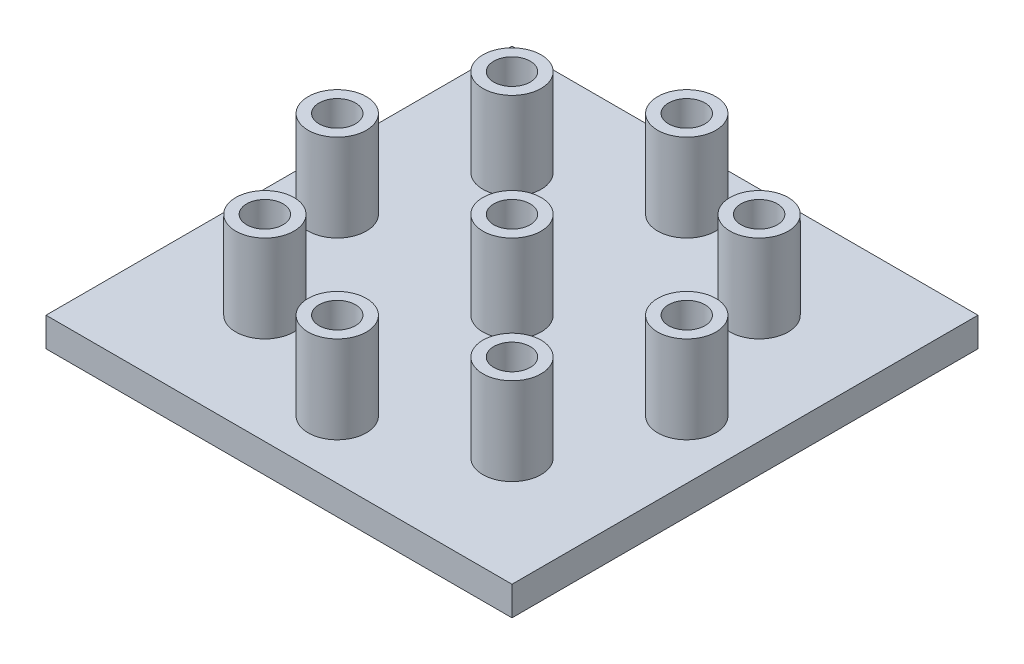
ISO-10303-21;
HEADER;
FILE_DESCRIPTION(('STEP AP214'),'2;1');
FILE_NAME('part.step','',(''),(''),'','','');
FILE_SCHEMA(('AUTOMOTIVE_DESIGN { 1 0 10303 214 1 1 1 1 }'));
ENDSEC;
DATA;
#1=APPLICATION_CONTEXT('core data for automotive mechanical design processes');
#2=APPLICATION_PROTOCOL_DEFINITION('international standard','automotive_design',2000,#1);
#3=PRODUCT_CONTEXT('',#1,'mechanical');
#4=PRODUCT('Part','Part','',(#3));
#5=PRODUCT_RELATED_PRODUCT_CATEGORY('part','',(#4));
#6=PRODUCT_DEFINITION_FORMATION('','',#4);
#7=PRODUCT_DEFINITION_CONTEXT('part definition',#1,'design');
#8=PRODUCT_DEFINITION('design','',#6,#7);
#9=PRODUCT_DEFINITION_SHAPE('','',#8);
#10=(LENGTH_UNIT() NAMED_UNIT(*) SI_UNIT(.MILLI.,.METRE.));
#11=(NAMED_UNIT(*) PLANE_ANGLE_UNIT() SI_UNIT($,.RADIAN.));
#12=(NAMED_UNIT(*) SI_UNIT($,.STERADIAN.) SOLID_ANGLE_UNIT());
#13=UNCERTAINTY_MEASURE_WITH_UNIT(LENGTH_MEASURE(1.E-05),#10,'distance_accuracy_value','');
#14=(GEOMETRIC_REPRESENTATION_CONTEXT(3) GLOBAL_UNCERTAINTY_ASSIGNED_CONTEXT((#13)) GLOBAL_UNIT_ASSIGNED_CONTEXT((#10,
#11,#12)) REPRESENTATION_CONTEXT('',''));
#15=CARTESIAN_POINT('',(0.,0.,0.));
#16=DIRECTION('',(0.,0.,1.));
#17=DIRECTION('',(1.,0.,0.));
#18=AXIS2_PLACEMENT_3D('',#15,#16,#17);
#19=CARTESIAN_POINT('',(25.4,3.175,25.4));
#20=DIRECTION('',(-1.,0.,0.));
#21=DIRECTION('',(0.,0.,1.));
#22=AXIS2_PLACEMENT_3D('',#19,#20,#21);
#23=PLANE('',#22);
#24=DIRECTION('',(0.,0.,-1.));
#25=VECTOR('',#24,1.);
#26=CARTESIAN_POINT('',(25.4,0.,25.4));
#27=LINE('',#26,#25);
#28=CARTESIAN_POINT('',(25.4,0.,25.4));
#29=VERTEX_POINT('',#28);
#30=CARTESIAN_POINT('',(25.4,0.,-25.4));
#31=VERTEX_POINT('',#30);
#32=EDGE_CURVE('E111',#29,#31,#27,.T.);
#33=ORIENTED_EDGE('',*,*,#32,.T.);
#34=DIRECTION('',(0.,-1.,0.));
#35=VECTOR('',#34,1.);
#36=CARTESIAN_POINT('',(25.4,3.175,-25.4));
#37=LINE('',#36,#35);
#38=CARTESIAN_POINT('',(25.4,3.175,-25.4));
#39=VERTEX_POINT('',#38);
#40=EDGE_CURVE('E100',#39,#31,#37,.T.);
#41=ORIENTED_EDGE('',*,*,#40,.F.);
#42=DIRECTION('',(0.,0.,-1.));
#43=VECTOR('',#42,1.);
#44=CARTESIAN_POINT('',(25.4,3.175,25.4));
#45=LINE('',#44,#43);
#46=CARTESIAN_POINT('',(25.4,3.175,25.4));
#47=VERTEX_POINT('',#46);
#48=EDGE_CURVE('E92',#47,#39,#45,.T.);
#49=ORIENTED_EDGE('',*,*,#48,.F.);
#50=DIRECTION('',(0.,-1.,0.));
#51=VECTOR('',#50,1.);
#52=CARTESIAN_POINT('',(25.4,3.175,25.4));
#53=LINE('',#52,#51);
#54=EDGE_CURVE('E107',#47,#29,#53,.T.);
#55=ORIENTED_EDGE('',*,*,#54,.T.);
#56=EDGE_LOOP('',(#33,#41,#49,#55));
#57=FACE_BOUND('',#56,.T.);
#58=ADVANCED_FACE('F39',(#57),#23,.F.);
#59=CARTESIAN_POINT('',(-25.4,3.175,-25.4));
#60=DIRECTION('',(0.,0.,1.));
#61=DIRECTION('',(1.,0.,0.));
#62=AXIS2_PLACEMENT_3D('',#59,#60,#61);
#63=PLANE('',#62);
#64=DIRECTION('',(-1.,0.,0.));
#65=VECTOR('',#64,1.);
#66=CARTESIAN_POINT('',(-25.4,0.,-25.4));
#67=LINE('',#66,#65);
#68=CARTESIAN_POINT('',(-25.4,0.,-25.4));
#69=VERTEX_POINT('',#68);
#70=EDGE_CURVE('E98',#31,#69,#67,.T.);
#71=ORIENTED_EDGE('',*,*,#70,.T.);
#72=DIRECTION('',(0.,-1.,0.));
#73=VECTOR('',#72,1.);
#74=CARTESIAN_POINT('',(-25.4,3.175,-25.4));
#75=LINE('',#74,#73);
#76=CARTESIAN_POINT('',(-25.4,3.175,-25.4));
#77=VERTEX_POINT('',#76);
#78=EDGE_CURVE('E96',#77,#69,#75,.T.);
#79=ORIENTED_EDGE('',*,*,#78,.F.);
#80=DIRECTION('',(-1.,0.,0.));
#81=VECTOR('',#80,1.);
#82=CARTESIAN_POINT('',(-25.4,3.175,-25.4));
#83=LINE('',#82,#81);
#84=EDGE_CURVE('E87',#39,#77,#83,.T.);
#85=ORIENTED_EDGE('',*,*,#84,.F.);
#86=ORIENTED_EDGE('',*,*,#40,.T.);
#87=EDGE_LOOP('',(#71,#79,#85,#86));
#88=FACE_BOUND('',#87,.T.);
#89=ADVANCED_FACE('F97',(#88),#63,.F.);
#90=CARTESIAN_POINT('',(-25.4,3.175,25.4));
#91=DIRECTION('',(1.,0.,0.));
#92=DIRECTION('',(0.,0.,-1.));
#93=AXIS2_PLACEMENT_3D('',#90,#91,#92);
#94=PLANE('',#93);
#95=DIRECTION('',(0.,0.,1.));
#96=VECTOR('',#95,1.);
#97=CARTESIAN_POINT('',(-25.4,0.,25.4));
#98=LINE('',#97,#96);
#99=CARTESIAN_POINT('',(-25.4,0.,25.4));
#100=VERTEX_POINT('',#99);
#101=EDGE_CURVE('E73',#69,#100,#98,.T.);
#102=ORIENTED_EDGE('',*,*,#101,.T.);
#103=DIRECTION('',(0.,-1.,0.));
#104=VECTOR('',#103,1.);
#105=CARTESIAN_POINT('',(-25.4,3.175,25.4));
#106=LINE('',#105,#104);
#107=CARTESIAN_POINT('',(-25.4,3.175,25.4));
#108=VERTEX_POINT('',#107);
#109=EDGE_CURVE('E101',#108,#100,#106,.T.);
#110=ORIENTED_EDGE('',*,*,#109,.F.);
#111=DIRECTION('',(0.,0.,1.));
#112=VECTOR('',#111,1.);
#113=CARTESIAN_POINT('',(-25.4,3.175,25.4));
#114=LINE('',#113,#112);
#115=EDGE_CURVE('E90',#77,#108,#114,.T.);
#116=ORIENTED_EDGE('',*,*,#115,.F.);
#117=ORIENTED_EDGE('',*,*,#78,.T.);
#118=EDGE_LOOP('',(#102,#110,#116,#117));
#119=FACE_BOUND('',#118,.T.);
#120=ADVANCED_FACE('F103',(#119),#94,.F.);
#121=CARTESIAN_POINT('',(-25.4,3.175,25.4));
#122=DIRECTION('',(0.,0.,-1.));
#123=DIRECTION('',(-1.,0.,0.));
#124=AXIS2_PLACEMENT_3D('',#121,#122,#123);
#125=PLANE('',#124);
#126=DIRECTION('',(1.,0.,0.));
#127=VECTOR('',#126,1.);
#128=CARTESIAN_POINT('',(-25.4,0.,25.4));
#129=LINE('',#128,#127);
#130=EDGE_CURVE('E79',#100,#29,#129,.T.);
#131=ORIENTED_EDGE('',*,*,#130,.T.);
#132=ORIENTED_EDGE('',*,*,#54,.F.);
#133=DIRECTION('',(1.,0.,0.));
#134=VECTOR('',#133,1.);
#135=CARTESIAN_POINT('',(-25.4,3.175,25.4));
#136=LINE('',#135,#134);
#137=EDGE_CURVE('E56',#108,#47,#136,.T.);
#138=ORIENTED_EDGE('',*,*,#137,.F.);
#139=ORIENTED_EDGE('',*,*,#109,.T.);
#140=EDGE_LOOP('',(#131,#132,#138,#139));
#141=FACE_BOUND('',#140,.T.);
#142=ADVANCED_FACE('F164',(#141),#125,.F.);
#143=CARTESIAN_POINT('',(0.,3.175,0.));
#144=DIRECTION('',(0.,-1.,0.));
#145=DIRECTION('',(0.,0.,-1.));
#146=AXIS2_PLACEMENT_3D('',#143,#144,#145);
#147=PLANE('',#146);
#148=CARTESIAN_POINT('',(-13.4703841816035,3.175,-13.4703841816032));
#149=DIRECTION('',(0.,-1.,0.));
#150=DIRECTION('',(0.,0.,-1.));
#151=AXIS2_PLACEMENT_3D('',#148,#149,#150);
#152=CIRCLE('',#151,3.175);
#153=CARTESIAN_POINT('',(-13.4703841816035,3.175,-16.6453841816032));
#154=VERTEX_POINT('',#153);
#155=EDGE_CURVE('E11',#154,#154,#152,.F.);
#156=ORIENTED_EDGE('',*,*,#155,.F.);
#157=EDGE_LOOP('',(#156));
#158=FACE_BOUND('',#157,.T.);
#159=CARTESIAN_POINT('',(-19.0499999999992,3.175,8.12150346973795E-13));
#160=DIRECTION('',(0.,-1.,0.));
#161=DIRECTION('',(0.,0.,-1.));
#162=AXIS2_PLACEMENT_3D('',#159,#160,#161);
#163=CIRCLE('',#162,3.175);
#164=CARTESIAN_POINT('',(-19.0499999999992,3.175,-3.17499999999919));
#165=VERTEX_POINT('',#164);
#166=EDGE_CURVE('E48',#165,#165,#163,.F.);
#167=ORIENTED_EDGE('',*,*,#166,.F.);
#168=EDGE_LOOP('',(#167));
#169=FACE_BOUND('',#168,.T.);
#170=CARTESIAN_POINT('',(-13.4703841816024,3.175,13.4703841816043));
#171=DIRECTION('',(0.,-1.,0.));
#172=DIRECTION('',(0.,0.,-1.));
#173=AXIS2_PLACEMENT_3D('',#170,#171,#172);
#174=CIRCLE('',#173,3.175);
#175=CARTESIAN_POINT('',(-13.4703841816024,3.175,10.2953841816043));
#176=VERTEX_POINT('',#175);
#177=EDGE_CURVE('E152',#176,#176,#174,.F.);
#178=ORIENTED_EDGE('',*,*,#177,.F.);
#179=EDGE_LOOP('',(#178));
#180=FACE_BOUND('',#179,.T.);
#181=CARTESIAN_POINT('',(1.61963478964284E-12,3.175,19.05));
#182=DIRECTION('',(0.,-1.,0.));
#183=DIRECTION('',(0.,0.,-1.));
#184=AXIS2_PLACEMENT_3D('',#181,#182,#183);
#185=CIRCLE('',#184,3.175);
#186=CARTESIAN_POINT('',(1.61963478964284E-12,3.175,15.875));
#187=VERTEX_POINT('',#186);
#188=EDGE_CURVE('E148',#187,#187,#185,.F.);
#189=ORIENTED_EDGE('',*,*,#188,.F.);
#190=EDGE_LOOP('',(#189));
#191=FACE_BOUND('',#190,.T.);
#192=CARTESIAN_POINT('',(13.4703841816051,3.175,13.4703841816032));
#193=DIRECTION('',(0.,-1.,0.));
#194=DIRECTION('',(0.,0.,-1.));
#195=AXIS2_PLACEMENT_3D('',#192,#193,#194);
#196=CIRCLE('',#195,3.175);
#197=CARTESIAN_POINT('',(13.4703841816051,3.175,10.2953841816032));
#198=VERTEX_POINT('',#197);
#199=EDGE_CURVE('E144',#198,#198,#196,.F.);
#200=ORIENTED_EDGE('',*,*,#199,.F.);
#201=EDGE_LOOP('',(#200));
#202=FACE_BOUND('',#201,.T.);
#203=CARTESIAN_POINT('',(19.0500000000008,3.175,-8.09817394821419E-13));
#204=DIRECTION('',(0.,-1.,0.));
#205=DIRECTION('',(0.,0.,-1.));
#206=AXIS2_PLACEMENT_3D('',#203,#204,#205);
#207=CIRCLE('',#206,3.175);
#208=CARTESIAN_POINT('',(19.0500000000008,3.175,-3.17500000000081));
#209=VERTEX_POINT('',#208);
#210=EDGE_CURVE('E140',#209,#209,#207,.F.);
#211=ORIENTED_EDGE('',*,*,#210,.F.);
#212=EDGE_LOOP('',(#211));
#213=FACE_BOUND('',#212,.T.);
#214=CARTESIAN_POINT('',(13.470384181604,3.175,-13.4703841816043));
#215=DIRECTION('',(0.,-1.,0.));
#216=DIRECTION('',(0.,0.,-1.));
#217=AXIS2_PLACEMENT_3D('',#214,#215,#216);
#218=CIRCLE('',#217,3.175);
#219=CARTESIAN_POINT('',(13.470384181604,3.175,-16.6453841816043));
#220=VERTEX_POINT('',#219);
#221=EDGE_CURVE('E136',#220,#220,#218,.F.);
#222=ORIENTED_EDGE('',*,*,#221,.F.);
#223=EDGE_LOOP('',(#222));
#224=FACE_BOUND('',#223,.T.);
#225=CARTESIAN_POINT('',(0.,3.175,0.));
#226=DIRECTION('',(0.,-1.,0.));
#227=DIRECTION('',(0.,0.,-1.));
#228=AXIS2_PLACEMENT_3D('',#225,#226,#227);
#229=CIRCLE('',#228,3.175);
#230=CARTESIAN_POINT('',(0.,3.175,-3.175));
#231=VERTEX_POINT('',#230);
#232=EDGE_CURVE('E132',#231,#231,#229,.F.);
#233=ORIENTED_EDGE('',*,*,#232,.F.);
#234=EDGE_LOOP('',(#233));
#235=FACE_BOUND('',#234,.T.);
#236=CARTESIAN_POINT('',(0.,3.175,-19.05));
#237=DIRECTION('',(0.,-1.,0.));
#238=DIRECTION('',(0.,0.,-1.));
#239=AXIS2_PLACEMENT_3D('',#236,#237,#238);
#240=CIRCLE('',#239,3.175);
#241=CARTESIAN_POINT('',(0.,3.175,-22.225));
#242=VERTEX_POINT('',#241);
#243=EDGE_CURVE('E128',#242,#242,#240,.F.);
#244=ORIENTED_EDGE('',*,*,#243,.F.);
#245=EDGE_LOOP('',(#244));
#246=FACE_BOUND('',#245,.T.);
#247=ORIENTED_EDGE('',*,*,#48,.T.);
#248=ORIENTED_EDGE('',*,*,#84,.T.);
#249=ORIENTED_EDGE('',*,*,#115,.T.);
#250=ORIENTED_EDGE('',*,*,#137,.T.);
#251=EDGE_LOOP('',(#247,#248,#249,#250));
#252=FACE_BOUND('',#251,.T.);
#253=ADVANCED_FACE('F88',(#158,#169,#180,#191,#202,#213,#224,#235,#246,#252),#147,.F.);
#254=CARTESIAN_POINT('',(0.,0.,0.));
#255=DIRECTION('',(0.,-1.,0.));
#256=DIRECTION('',(0.,0.,-1.));
#257=AXIS2_PLACEMENT_3D('',#254,#255,#256);
#258=PLANE('',#257);
#259=CARTESIAN_POINT('',(0.,0.,-19.05));
#260=DIRECTION('',(0.,1.,0.));
#261=DIRECTION('',(0.,0.,1.));
#262=AXIS2_PLACEMENT_3D('',#259,#260,#261);
#263=CIRCLE('',#262,1.98374);
#264=CARTESIAN_POINT('',(0.,0.,-17.06626));
#265=VERTEX_POINT('',#264);
#266=EDGE_CURVE('E500',#265,#265,#263,.T.);
#267=ORIENTED_EDGE('',*,*,#266,.T.);
#268=EDGE_LOOP('',(#267));
#269=FACE_BOUND('',#268,.T.);
#270=CARTESIAN_POINT('',(-13.4703841816035,0.,-13.4703841816032));
#271=DIRECTION('',(0.,1.,0.));
#272=DIRECTION('',(0.,0.,1.));
#273=AXIS2_PLACEMENT_3D('',#270,#271,#272);
#274=CIRCLE('',#273,1.98374);
#275=CARTESIAN_POINT('',(-13.4703841816035,0.,-11.4866441816032));
#276=VERTEX_POINT('',#275);
#277=EDGE_CURVE('E540',#276,#276,#274,.T.);
#278=ORIENTED_EDGE('',*,*,#277,.T.);
#279=EDGE_LOOP('',(#278));
#280=FACE_BOUND('',#279,.T.);
#281=CARTESIAN_POINT('',(-19.0499999999992,0.,8.12150346973795E-13));
#282=DIRECTION('',(0.,1.,0.));
#283=DIRECTION('',(0.,0.,1.));
#284=AXIS2_PLACEMENT_3D('',#281,#282,#283);
#285=CIRCLE('',#284,1.98374);
#286=CARTESIAN_POINT('',(-19.0499999999992,0.,1.98374000000081));
#287=VERTEX_POINT('',#286);
#288=EDGE_CURVE('E532',#287,#287,#285,.T.);
#289=ORIENTED_EDGE('',*,*,#288,.T.);
#290=EDGE_LOOP('',(#289));
#291=FACE_BOUND('',#290,.T.);
#292=CARTESIAN_POINT('',(-13.4703841816024,0.,13.4703841816043));
#293=DIRECTION('',(0.,1.,0.));
#294=DIRECTION('',(0.,0.,1.));
#295=AXIS2_PLACEMENT_3D('',#292,#293,#294);
#296=CIRCLE('',#295,1.98374);
#297=CARTESIAN_POINT('',(-13.4703841816024,0.,15.4541241816043));
#298=VERTEX_POINT('',#297);
#299=EDGE_CURVE('E524',#298,#298,#296,.T.);
#300=ORIENTED_EDGE('',*,*,#299,.T.);
#301=EDGE_LOOP('',(#300));
#302=FACE_BOUND('',#301,.T.);
#303=CARTESIAN_POINT('',(1.61963478964284E-12,0.,19.05));
#304=DIRECTION('',(0.,1.,0.));
#305=DIRECTION('',(0.,0.,1.));
#306=AXIS2_PLACEMENT_3D('',#303,#304,#305);
#307=CIRCLE('',#306,1.98374);
#308=CARTESIAN_POINT('',(1.61963478964284E-12,0.,21.03374));
#309=VERTEX_POINT('',#308);
#310=EDGE_CURVE('E515',#309,#309,#307,.T.);
#311=ORIENTED_EDGE('',*,*,#310,.T.);
#312=EDGE_LOOP('',(#311));
#313=FACE_BOUND('',#312,.T.);
#314=CARTESIAN_POINT('',(0.,0.,0.));
#315=DIRECTION('',(0.,1.,0.));
#316=DIRECTION('',(0.,0.,1.));
#317=AXIS2_PLACEMENT_3D('',#314,#315,#316);
#318=CIRCLE('',#317,1.98374);
#319=CARTESIAN_POINT('',(0.,0.,1.98374));
#320=VERTEX_POINT('',#319);
#321=EDGE_CURVE('E505',#320,#320,#318,.T.);
#322=ORIENTED_EDGE('',*,*,#321,.T.);
#323=EDGE_LOOP('',(#322));
#324=FACE_BOUND('',#323,.T.);
#325=CARTESIAN_POINT('',(13.470384181604,0.,-13.4703841816043));
#326=DIRECTION('',(0.,1.,0.));
#327=DIRECTION('',(0.,0.,1.));
#328=AXIS2_PLACEMENT_3D('',#325,#326,#327);
#329=CIRCLE('',#328,1.98374);
#330=CARTESIAN_POINT('',(13.470384181604,0.,-11.4866441816043));
#331=VERTEX_POINT('',#330);
#332=EDGE_CURVE('E567',#331,#331,#329,.T.);
#333=ORIENTED_EDGE('',*,*,#332,.T.);
#334=EDGE_LOOP('',(#333));
#335=FACE_BOUND('',#334,.T.);
#336=CARTESIAN_POINT('',(19.0500000000008,0.,-8.09817394821419E-13));
#337=DIRECTION('',(0.,1.,0.));
#338=DIRECTION('',(0.,0.,1.));
#339=AXIS2_PLACEMENT_3D('',#336,#337,#338);
#340=CIRCLE('',#339,1.98374);
#341=CARTESIAN_POINT('',(19.0500000000008,0.,1.98373999999919));
#342=VERTEX_POINT('',#341);
#343=EDGE_CURVE('E548',#342,#342,#340,.T.);
#344=ORIENTED_EDGE('',*,*,#343,.T.);
#345=EDGE_LOOP('',(#344));
#346=FACE_BOUND('',#345,.T.);
#347=CARTESIAN_POINT('',(13.4703841816051,0.,13.4703841816032));
#348=DIRECTION('',(0.,1.,0.));
#349=DIRECTION('',(0.,0.,1.));
#350=AXIS2_PLACEMENT_3D('',#347,#348,#349);
#351=CIRCLE('',#350,1.98374);
#352=CARTESIAN_POINT('',(13.4703841816051,0.,15.4541241816032));
#353=VERTEX_POINT('',#352);
#354=EDGE_CURVE('E557',#353,#353,#351,.T.);
#355=ORIENTED_EDGE('',*,*,#354,.T.);
#356=EDGE_LOOP('',(#355));
#357=FACE_BOUND('',#356,.T.);
#358=ORIENTED_EDGE('',*,*,#32,.F.);
#359=ORIENTED_EDGE('',*,*,#130,.F.);
#360=ORIENTED_EDGE('',*,*,#101,.F.);
#361=ORIENTED_EDGE('',*,*,#70,.F.);
#362=EDGE_LOOP('',(#358,#359,#360,#361));
#363=FACE_BOUND('',#362,.T.);
#364=ADVANCED_FACE('F163',(#269,#280,#291,#302,#313,#324,#335,#346,#357,#363),#258,.T.);
#365=CARTESIAN_POINT('',(0.,12.7,-19.05));
#366=DIRECTION('',(0.,-1.,0.));
#367=DIRECTION('',(0.,0.,-1.));
#368=AXIS2_PLACEMENT_3D('',#365,#366,#367);
#369=CYLINDRICAL_SURFACE('',#368,3.175);
#370=CARTESIAN_POINT('',(0.,12.7,-19.05));
#371=DIRECTION('',(0.,1.,0.));
#372=DIRECTION('',(0.,0.,1.));
#373=AXIS2_PLACEMENT_3D('',#370,#371,#372);
#374=CIRCLE('',#373,3.175);
#375=CARTESIAN_POINT('',(0.,12.7,-15.875));
#376=VERTEX_POINT('',#375);
#377=EDGE_CURVE('E115',#376,#376,#374,.T.);
#378=ORIENTED_EDGE('',*,*,#377,.F.);
#379=EDGE_LOOP('',(#378));
#380=FACE_BOUND('',#379,.T.);
#381=ORIENTED_EDGE('',*,*,#243,.T.);
#382=EDGE_LOOP('',(#381));
#383=FACE_BOUND('',#382,.T.);
#384=ADVANCED_FACE('F181',(#380,#383),#369,.T.);
#385=CARTESIAN_POINT('',(0.,12.7,-19.05));
#386=DIRECTION('',(0.,1.,0.));
#387=DIRECTION('',(0.,0.,1.));
#388=AXIS2_PLACEMENT_3D('',#385,#386,#387);
#389=PLANE('',#388);
#390=CARTESIAN_POINT('',(0.,12.7,-19.05));
#391=DIRECTION('',(0.,1.,0.));
#392=DIRECTION('',(0.,0.,1.));
#393=AXIS2_PLACEMENT_3D('',#390,#391,#392);
#394=CIRCLE('',#393,1.98374);
#395=CARTESIAN_POINT('',(0.,12.7,-17.06626));
#396=VERTEX_POINT('',#395);
#397=EDGE_CURVE('E503',#396,#396,#394,.T.);
#398=ORIENTED_EDGE('',*,*,#397,.F.);
#399=EDGE_LOOP('',(#398));
#400=FACE_BOUND('',#399,.T.);
#401=ORIENTED_EDGE('',*,*,#377,.T.);
#402=EDGE_LOOP('',(#401));
#403=FACE_BOUND('',#402,.T.);
#404=ADVANCED_FACE('F183',(#400,#403),#389,.T.);
#405=CARTESIAN_POINT('',(0.,12.7,0.));
#406=DIRECTION('',(0.,-1.,0.));
#407=DIRECTION('',(0.,0.,-1.));
#408=AXIS2_PLACEMENT_3D('',#405,#406,#407);
#409=CYLINDRICAL_SURFACE('',#408,3.175);
#410=CARTESIAN_POINT('',(0.,12.7,0.));
#411=DIRECTION('',(0.,1.,0.));
#412=DIRECTION('',(0.,0.,1.));
#413=AXIS2_PLACEMENT_3D('',#410,#411,#412);
#414=CIRCLE('',#413,3.175);
#415=CARTESIAN_POINT('',(0.,12.7,3.175));
#416=VERTEX_POINT('',#415);
#417=EDGE_CURVE('E601',#416,#416,#414,.T.);
#418=ORIENTED_EDGE('',*,*,#417,.F.);
#419=EDGE_LOOP('',(#418));
#420=FACE_BOUND('',#419,.T.);
#421=ORIENTED_EDGE('',*,*,#232,.T.);
#422=EDGE_LOOP('',(#421));
#423=FACE_BOUND('',#422,.T.);
#424=ADVANCED_FACE('F190',(#420,#423),#409,.T.);
#425=CARTESIAN_POINT('',(0.,12.7,0.));
#426=DIRECTION('',(0.,1.,0.));
#427=DIRECTION('',(0.,0.,1.));
#428=AXIS2_PLACEMENT_3D('',#425,#426,#427);
#429=PLANE('',#428);
#430=CARTESIAN_POINT('',(0.,12.7,0.));
#431=DIRECTION('',(0.,1.,0.));
#432=DIRECTION('',(0.,0.,1.));
#433=AXIS2_PLACEMENT_3D('',#430,#431,#432);
#434=CIRCLE('',#433,1.98374);
#435=CARTESIAN_POINT('',(0.,12.7,1.98374));
#436=VERTEX_POINT('',#435);
#437=EDGE_CURVE('E512',#436,#436,#434,.T.);
#438=ORIENTED_EDGE('',*,*,#437,.F.);
#439=EDGE_LOOP('',(#438));
#440=FACE_BOUND('',#439,.T.);
#441=ORIENTED_EDGE('',*,*,#417,.T.);
#442=EDGE_LOOP('',(#441));
#443=FACE_BOUND('',#442,.T.);
#444=ADVANCED_FACE('F256',(#440,#443),#429,.T.);
#445=CARTESIAN_POINT('',(13.470384181604,12.7,-13.4703841816043));
#446=DIRECTION('',(0.,-1.,0.));
#447=DIRECTION('',(0.,0.,-1.));
#448=AXIS2_PLACEMENT_3D('',#445,#446,#447);
#449=CYLINDRICAL_SURFACE('',#448,3.175);
#450=CARTESIAN_POINT('',(13.470384181604,12.7,-13.4703841816043));
#451=DIRECTION('',(0.,1.,0.));
#452=DIRECTION('',(0.,0.,1.));
#453=AXIS2_PLACEMENT_3D('',#450,#451,#452);
#454=CIRCLE('',#453,3.175);
#455=CARTESIAN_POINT('',(13.470384181604,12.7,-10.2953841816043));
#456=VERTEX_POINT('',#455);
#457=EDGE_CURVE('E597',#456,#456,#454,.T.);
#458=ORIENTED_EDGE('',*,*,#457,.F.);
#459=EDGE_LOOP('',(#458));
#460=FACE_BOUND('',#459,.T.);
#461=ORIENTED_EDGE('',*,*,#221,.T.);
#462=EDGE_LOOP('',(#461));
#463=FACE_BOUND('',#462,.T.);
#464=ADVANCED_FACE('F265',(#460,#463),#449,.T.);
#465=CARTESIAN_POINT('',(13.470384181604,12.7,-13.4703841816043));
#466=DIRECTION('',(0.,1.,0.));
#467=DIRECTION('',(0.,0.,1.));
#468=AXIS2_PLACEMENT_3D('',#465,#466,#467);
#469=PLANE('',#468);
#470=CARTESIAN_POINT('',(13.470384181604,12.7,-13.4703841816043));
#471=DIRECTION('',(0.,1.,0.));
#472=DIRECTION('',(0.,0.,1.));
#473=AXIS2_PLACEMENT_3D('',#470,#471,#472);
#474=CIRCLE('',#473,1.98374);
#475=CARTESIAN_POINT('',(13.470384181604,12.7,-11.4866441816043));
#476=VERTEX_POINT('',#475);
#477=EDGE_CURVE('E552',#476,#476,#474,.T.);
#478=ORIENTED_EDGE('',*,*,#477,.F.);
#479=EDGE_LOOP('',(#478));
#480=FACE_BOUND('',#479,.T.);
#481=ORIENTED_EDGE('',*,*,#457,.T.);
#482=EDGE_LOOP('',(#481));
#483=FACE_BOUND('',#482,.T.);
#484=ADVANCED_FACE('F274',(#480,#483),#469,.T.);
#485=CARTESIAN_POINT('',(19.0500000000008,12.7,-8.09817394821419E-13));
#486=DIRECTION('',(0.,-1.,0.));
#487=DIRECTION('',(0.,0.,-1.));
#488=AXIS2_PLACEMENT_3D('',#485,#486,#487);
#489=CYLINDRICAL_SURFACE('',#488,3.175);
#490=CARTESIAN_POINT('',(19.0500000000008,12.7,-8.09817394821419E-13));
#491=DIRECTION('',(0.,1.,0.));
#492=DIRECTION('',(0.,0.,1.));
#493=AXIS2_PLACEMENT_3D('',#490,#491,#492);
#494=CIRCLE('',#493,3.175);
#495=CARTESIAN_POINT('',(19.0500000000008,12.7,3.17499999999919));
#496=VERTEX_POINT('',#495);
#497=EDGE_CURVE('E593',#496,#496,#494,.T.);
#498=ORIENTED_EDGE('',*,*,#497,.F.);
#499=EDGE_LOOP('',(#498));
#500=FACE_BOUND('',#499,.T.);
#501=ORIENTED_EDGE('',*,*,#210,.T.);
#502=EDGE_LOOP('',(#501));
#503=FACE_BOUND('',#502,.T.);
#504=ADVANCED_FACE('F283',(#500,#503),#489,.T.);
#505=CARTESIAN_POINT('',(19.0500000000008,12.7,-8.09817394821419E-13));
#506=DIRECTION('',(0.,1.,0.));
#507=DIRECTION('',(0.,0.,1.));
#508=AXIS2_PLACEMENT_3D('',#505,#506,#507);
#509=PLANE('',#508);
#510=CARTESIAN_POINT('',(19.0500000000008,12.7,-8.09817394821419E-13));
#511=DIRECTION('',(0.,1.,0.));
#512=DIRECTION('',(0.,0.,1.));
#513=AXIS2_PLACEMENT_3D('',#510,#511,#512);
#514=CIRCLE('',#513,1.98374);
#515=CARTESIAN_POINT('',(19.0500000000008,12.7,1.98373999999919));
#516=VERTEX_POINT('',#515);
#517=EDGE_CURVE('E553',#516,#516,#514,.T.);
#518=ORIENTED_EDGE('',*,*,#517,.F.);
#519=EDGE_LOOP('',(#518));
#520=FACE_BOUND('',#519,.T.);
#521=ORIENTED_EDGE('',*,*,#497,.T.);
#522=EDGE_LOOP('',(#521));
#523=FACE_BOUND('',#522,.T.);
#524=ADVANCED_FACE('F292',(#520,#523),#509,.T.);
#525=CARTESIAN_POINT('',(13.4703841816051,12.7,13.4703841816032));
#526=DIRECTION('',(0.,-1.,0.));
#527=DIRECTION('',(0.,0.,-1.));
#528=AXIS2_PLACEMENT_3D('',#525,#526,#527);
#529=CYLINDRICAL_SURFACE('',#528,3.175);
#530=CARTESIAN_POINT('',(13.4703841816051,12.7,13.4703841816032));
#531=DIRECTION('',(0.,1.,0.));
#532=DIRECTION('',(0.,0.,1.));
#533=AXIS2_PLACEMENT_3D('',#530,#531,#532);
#534=CIRCLE('',#533,3.175);
#535=CARTESIAN_POINT('',(13.4703841816051,12.7,16.6453841816032));
#536=VERTEX_POINT('',#535);
#537=EDGE_CURVE('E589',#536,#536,#534,.T.);
#538=ORIENTED_EDGE('',*,*,#537,.F.);
#539=EDGE_LOOP('',(#538));
#540=FACE_BOUND('',#539,.T.);
#541=ORIENTED_EDGE('',*,*,#199,.T.);
#542=EDGE_LOOP('',(#541));
#543=FACE_BOUND('',#542,.T.);
#544=ADVANCED_FACE('F301',(#540,#543),#529,.T.);
#545=CARTESIAN_POINT('',(13.4703841816051,12.7,13.4703841816032));
#546=DIRECTION('',(0.,1.,0.));
#547=DIRECTION('',(0.,0.,1.));
#548=AXIS2_PLACEMENT_3D('',#545,#546,#547);
#549=PLANE('',#548);
#550=CARTESIAN_POINT('',(13.4703841816051,12.7,13.4703841816032));
#551=DIRECTION('',(0.,1.,0.));
#552=DIRECTION('',(0.,0.,1.));
#553=AXIS2_PLACEMENT_3D('',#550,#551,#552);
#554=CIRCLE('',#553,1.98374);
#555=CARTESIAN_POINT('',(13.4703841816051,12.7,15.4541241816032));
#556=VERTEX_POINT('',#555);
#557=EDGE_CURVE('E519',#556,#556,#554,.T.);
#558=ORIENTED_EDGE('',*,*,#557,.F.);
#559=EDGE_LOOP('',(#558));
#560=FACE_BOUND('',#559,.T.);
#561=ORIENTED_EDGE('',*,*,#537,.T.);
#562=EDGE_LOOP('',(#561));
#563=FACE_BOUND('',#562,.T.);
#564=ADVANCED_FACE('F310',(#560,#563),#549,.T.);
#565=CARTESIAN_POINT('',(1.61963478964284E-12,12.7,19.05));
#566=DIRECTION('',(0.,-1.,0.));
#567=DIRECTION('',(0.,0.,-1.));
#568=AXIS2_PLACEMENT_3D('',#565,#566,#567);
#569=CYLINDRICAL_SURFACE('',#568,3.175);
#570=CARTESIAN_POINT('',(1.61963478964284E-12,12.7,19.05));
#571=DIRECTION('',(0.,1.,0.));
#572=DIRECTION('',(0.,0.,1.));
#573=AXIS2_PLACEMENT_3D('',#570,#571,#572);
#574=CIRCLE('',#573,3.175);
#575=CARTESIAN_POINT('',(1.61963478964284E-12,12.7,22.225));
#576=VERTEX_POINT('',#575);
#577=EDGE_CURVE('E585',#576,#576,#574,.T.);
#578=ORIENTED_EDGE('',*,*,#577,.F.);
#579=EDGE_LOOP('',(#578));
#580=FACE_BOUND('',#579,.T.);
#581=ORIENTED_EDGE('',*,*,#188,.T.);
#582=EDGE_LOOP('',(#581));
#583=FACE_BOUND('',#582,.T.);
#584=ADVANCED_FACE('F319',(#580,#583),#569,.T.);
#585=CARTESIAN_POINT('',(1.61963478964284E-12,12.7,19.05));
#586=DIRECTION('',(0.,1.,0.));
#587=DIRECTION('',(0.,0.,1.));
#588=AXIS2_PLACEMENT_3D('',#585,#586,#587);
#589=PLANE('',#588);
#590=CARTESIAN_POINT('',(1.61963478964284E-12,12.7,19.05));
#591=DIRECTION('',(0.,1.,0.));
#592=DIRECTION('',(0.,0.,1.));
#593=AXIS2_PLACEMENT_3D('',#590,#591,#592);
#594=CIRCLE('',#593,1.98374);
#595=CARTESIAN_POINT('',(1.61963478964284E-12,12.7,21.03374));
#596=VERTEX_POINT('',#595);
#597=EDGE_CURVE('E520',#596,#596,#594,.T.);
#598=ORIENTED_EDGE('',*,*,#597,.F.);
#599=EDGE_LOOP('',(#598));
#600=FACE_BOUND('',#599,.T.);
#601=ORIENTED_EDGE('',*,*,#577,.T.);
#602=EDGE_LOOP('',(#601));
#603=FACE_BOUND('',#602,.T.);
#604=ADVANCED_FACE('F328',(#600,#603),#589,.T.);
#605=CARTESIAN_POINT('',(-13.4703841816024,12.7,13.4703841816043));
#606=DIRECTION('',(0.,-1.,0.));
#607=DIRECTION('',(0.,0.,-1.));
#608=AXIS2_PLACEMENT_3D('',#605,#606,#607);
#609=CYLINDRICAL_SURFACE('',#608,3.175);
#610=CARTESIAN_POINT('',(-13.4703841816024,12.7,13.4703841816043));
#611=DIRECTION('',(0.,1.,0.));
#612=DIRECTION('',(0.,0.,1.));
#613=AXIS2_PLACEMENT_3D('',#610,#611,#612);
#614=CIRCLE('',#613,3.175);
#615=CARTESIAN_POINT('',(-13.4703841816024,12.7,16.6453841816043));
#616=VERTEX_POINT('',#615);
#617=EDGE_CURVE('E581',#616,#616,#614,.T.);
#618=ORIENTED_EDGE('',*,*,#617,.F.);
#619=EDGE_LOOP('',(#618));
#620=FACE_BOUND('',#619,.T.);
#621=ORIENTED_EDGE('',*,*,#177,.T.);
#622=EDGE_LOOP('',(#621));
#623=FACE_BOUND('',#622,.T.);
#624=ADVANCED_FACE('F337',(#620,#623),#609,.T.);
#625=CARTESIAN_POINT('',(-13.4703841816024,12.7,13.4703841816043));
#626=DIRECTION('',(0.,1.,0.));
#627=DIRECTION('',(0.,0.,1.));
#628=AXIS2_PLACEMENT_3D('',#625,#626,#627);
#629=PLANE('',#628);
#630=CARTESIAN_POINT('',(-13.4703841816024,12.7,13.4703841816043));
#631=DIRECTION('',(0.,1.,0.));
#632=DIRECTION('',(0.,0.,1.));
#633=AXIS2_PLACEMENT_3D('',#630,#631,#632);
#634=CIRCLE('',#633,1.98374);
#635=CARTESIAN_POINT('',(-13.4703841816024,12.7,15.4541241816043));
#636=VERTEX_POINT('',#635);
#637=EDGE_CURVE('E528',#636,#636,#634,.T.);
#638=ORIENTED_EDGE('',*,*,#637,.F.);
#639=EDGE_LOOP('',(#638));
#640=FACE_BOUND('',#639,.T.);
#641=ORIENTED_EDGE('',*,*,#617,.T.);
#642=EDGE_LOOP('',(#641));
#643=FACE_BOUND('',#642,.T.);
#644=ADVANCED_FACE('F346',(#640,#643),#629,.T.);
#645=CARTESIAN_POINT('',(-19.0499999999992,12.7,8.12150346973795E-13));
#646=DIRECTION('',(0.,-1.,0.));
#647=DIRECTION('',(0.,0.,-1.));
#648=AXIS2_PLACEMENT_3D('',#645,#646,#647);
#649=CYLINDRICAL_SURFACE('',#648,3.175);
#650=CARTESIAN_POINT('',(-19.0499999999992,12.7,8.12150346973795E-13));
#651=DIRECTION('',(0.,1.,0.));
#652=DIRECTION('',(0.,0.,1.));
#653=AXIS2_PLACEMENT_3D('',#650,#651,#652);
#654=CIRCLE('',#653,3.175);
#655=CARTESIAN_POINT('',(-19.0499999999992,12.7,3.17500000000081));
#656=VERTEX_POINT('',#655);
#657=EDGE_CURVE('E577',#656,#656,#654,.T.);
#658=ORIENTED_EDGE('',*,*,#657,.F.);
#659=EDGE_LOOP('',(#658));
#660=FACE_BOUND('',#659,.T.);
#661=ORIENTED_EDGE('',*,*,#166,.T.);
#662=EDGE_LOOP('',(#661));
#663=FACE_BOUND('',#662,.T.);
#664=ADVANCED_FACE('F159',(#660,#663),#649,.T.);
#665=CARTESIAN_POINT('',(-19.0499999999992,12.7,8.12150346973795E-13));
#666=DIRECTION('',(0.,1.,0.));
#667=DIRECTION('',(0.,0.,1.));
#668=AXIS2_PLACEMENT_3D('',#665,#666,#667);
#669=PLANE('',#668);
#670=CARTESIAN_POINT('',(-19.0499999999992,12.7,8.12150346973795E-13));
#671=DIRECTION('',(0.,1.,0.));
#672=DIRECTION('',(0.,0.,1.));
#673=AXIS2_PLACEMENT_3D('',#670,#671,#672);
#674=CIRCLE('',#673,1.98374);
#675=CARTESIAN_POINT('',(-19.0499999999992,12.7,1.98374000000081));
#676=VERTEX_POINT('',#675);
#677=EDGE_CURVE('E536',#676,#676,#674,.T.);
#678=ORIENTED_EDGE('',*,*,#677,.F.);
#679=EDGE_LOOP('',(#678));
#680=FACE_BOUND('',#679,.T.);
#681=ORIENTED_EDGE('',*,*,#657,.T.);
#682=EDGE_LOOP('',(#681));
#683=FACE_BOUND('',#682,.T.);
#684=ADVANCED_FACE('F363',(#680,#683),#669,.T.);
#685=CARTESIAN_POINT('',(-13.4703841816035,12.7,-13.4703841816032));
#686=DIRECTION('',(0.,-1.,0.));
#687=DIRECTION('',(0.,0.,-1.));
#688=AXIS2_PLACEMENT_3D('',#685,#686,#687);
#689=CYLINDRICAL_SURFACE('',#688,3.175);
#690=CARTESIAN_POINT('',(-13.4703841816035,12.7,-13.4703841816032));
#691=DIRECTION('',(0.,1.,0.));
#692=DIRECTION('',(0.,0.,1.));
#693=AXIS2_PLACEMENT_3D('',#690,#691,#692);
#694=CIRCLE('',#693,3.175);
#695=CARTESIAN_POINT('',(-13.4703841816035,12.7,-10.2953841816032));
#696=VERTEX_POINT('',#695);
#697=EDGE_CURVE('E509',#696,#696,#694,.T.);
#698=ORIENTED_EDGE('',*,*,#697,.F.);
#699=EDGE_LOOP('',(#698));
#700=FACE_BOUND('',#699,.T.);
#701=ORIENTED_EDGE('',*,*,#155,.T.);
#702=EDGE_LOOP('',(#701));
#703=FACE_BOUND('',#702,.T.);
#704=ADVANCED_FACE('F371',(#700,#703),#689,.T.);
#705=CARTESIAN_POINT('',(-13.4703841816035,12.7,-13.4703841816032));
#706=DIRECTION('',(0.,1.,0.));
#707=DIRECTION('',(0.,0.,1.));
#708=AXIS2_PLACEMENT_3D('',#705,#706,#707);
#709=PLANE('',#708);
#710=CARTESIAN_POINT('',(-13.4703841816035,12.7,-13.4703841816032));
#711=DIRECTION('',(0.,1.,0.));
#712=DIRECTION('',(0.,0.,1.));
#713=AXIS2_PLACEMENT_3D('',#710,#711,#712);
#714=CIRCLE('',#713,1.98374);
#715=CARTESIAN_POINT('',(-13.4703841816035,12.7,-11.4866441816032));
#716=VERTEX_POINT('',#715);
#717=EDGE_CURVE('E544',#716,#716,#714,.T.);
#718=ORIENTED_EDGE('',*,*,#717,.F.);
#719=EDGE_LOOP('',(#718));
#720=FACE_BOUND('',#719,.T.);
#721=ORIENTED_EDGE('',*,*,#697,.T.);
#722=EDGE_LOOP('',(#721));
#723=FACE_BOUND('',#722,.T.);
#724=ADVANCED_FACE('F380',(#720,#723),#709,.T.);
#725=CARTESIAN_POINT('',(-13.4703841816035,0.,-13.4703841816032));
#726=DIRECTION('',(0.,1.,0.));
#727=DIRECTION('',(0.,0.,1.));
#728=AXIS2_PLACEMENT_3D('',#725,#726,#727);
#729=CYLINDRICAL_SURFACE('',#728,1.98374);
#730=ORIENTED_EDGE('',*,*,#277,.F.);
#731=EDGE_LOOP('',(#730));
#732=FACE_BOUND('',#731,.T.);
#733=ORIENTED_EDGE('',*,*,#717,.T.);
#734=EDGE_LOOP('',(#733));
#735=FACE_BOUND('',#734,.T.);
#736=ADVANCED_FACE('F388',(#732,#735),#729,.F.);
#737=CARTESIAN_POINT('',(-19.0499999999992,0.,8.12150346973795E-13));
#738=DIRECTION('',(0.,1.,0.));
#739=DIRECTION('',(0.,0.,1.));
#740=AXIS2_PLACEMENT_3D('',#737,#738,#739);
#741=CYLINDRICAL_SURFACE('',#740,1.98374);
#742=ORIENTED_EDGE('',*,*,#288,.F.);
#743=EDGE_LOOP('',(#742));
#744=FACE_BOUND('',#743,.T.);
#745=ORIENTED_EDGE('',*,*,#677,.T.);
#746=EDGE_LOOP('',(#745));
#747=FACE_BOUND('',#746,.T.);
#748=ADVANCED_FACE('F397',(#744,#747),#741,.F.);
#749=CARTESIAN_POINT('',(-13.4703841816024,0.,13.4703841816043));
#750=DIRECTION('',(0.,1.,0.));
#751=DIRECTION('',(0.,0.,1.));
#752=AXIS2_PLACEMENT_3D('',#749,#750,#751);
#753=CYLINDRICAL_SURFACE('',#752,1.98374);
#754=ORIENTED_EDGE('',*,*,#299,.F.);
#755=EDGE_LOOP('',(#754));
#756=FACE_BOUND('',#755,.T.);
#757=ORIENTED_EDGE('',*,*,#637,.T.);
#758=EDGE_LOOP('',(#757));
#759=FACE_BOUND('',#758,.T.);
#760=ADVANCED_FACE('F406',(#756,#759),#753,.F.);
#761=CARTESIAN_POINT('',(1.61963478964284E-12,0.,19.05));
#762=DIRECTION('',(0.,1.,0.));
#763=DIRECTION('',(0.,0.,1.));
#764=AXIS2_PLACEMENT_3D('',#761,#762,#763);
#765=CYLINDRICAL_SURFACE('',#764,1.98374);
#766=ORIENTED_EDGE('',*,*,#310,.F.);
#767=EDGE_LOOP('',(#766));
#768=FACE_BOUND('',#767,.T.);
#769=ORIENTED_EDGE('',*,*,#597,.T.);
#770=EDGE_LOOP('',(#769));
#771=FACE_BOUND('',#770,.T.);
#772=ADVANCED_FACE('F415',(#768,#771),#765,.F.);
#773=CARTESIAN_POINT('',(13.4703841816051,0.,13.4703841816032));
#774=DIRECTION('',(0.,1.,0.));
#775=DIRECTION('',(0.,0.,1.));
#776=AXIS2_PLACEMENT_3D('',#773,#774,#775);
#777=CYLINDRICAL_SURFACE('',#776,1.98374);
#778=ORIENTED_EDGE('',*,*,#354,.F.);
#779=EDGE_LOOP('',(#778));
#780=FACE_BOUND('',#779,.T.);
#781=ORIENTED_EDGE('',*,*,#557,.T.);
#782=EDGE_LOOP('',(#781));
#783=FACE_BOUND('',#782,.T.);
#784=ADVANCED_FACE('F424',(#780,#783),#777,.F.);
#785=CARTESIAN_POINT('',(19.0500000000008,0.,-8.09817394821419E-13));
#786=DIRECTION('',(0.,1.,0.));
#787=DIRECTION('',(0.,0.,1.));
#788=AXIS2_PLACEMENT_3D('',#785,#786,#787);
#789=CYLINDRICAL_SURFACE('',#788,1.98374);
#790=ORIENTED_EDGE('',*,*,#343,.F.);
#791=EDGE_LOOP('',(#790));
#792=FACE_BOUND('',#791,.T.);
#793=ORIENTED_EDGE('',*,*,#517,.T.);
#794=EDGE_LOOP('',(#793));
#795=FACE_BOUND('',#794,.T.);
#796=ADVANCED_FACE('F433',(#792,#795),#789,.F.);
#797=CARTESIAN_POINT('',(13.470384181604,0.,-13.4703841816043));
#798=DIRECTION('',(0.,1.,0.));
#799=DIRECTION('',(0.,0.,1.));
#800=AXIS2_PLACEMENT_3D('',#797,#798,#799);
#801=CYLINDRICAL_SURFACE('',#800,1.98374);
#802=ORIENTED_EDGE('',*,*,#332,.F.);
#803=EDGE_LOOP('',(#802));
#804=FACE_BOUND('',#803,.T.);
#805=ORIENTED_EDGE('',*,*,#477,.T.);
#806=EDGE_LOOP('',(#805));
#807=FACE_BOUND('',#806,.T.);
#808=ADVANCED_FACE('F442',(#804,#807),#801,.F.);
#809=CARTESIAN_POINT('',(0.,0.,0.));
#810=DIRECTION('',(0.,1.,0.));
#811=DIRECTION('',(0.,0.,1.));
#812=AXIS2_PLACEMENT_3D('',#809,#810,#811);
#813=CYLINDRICAL_SURFACE('',#812,1.98374);
#814=ORIENTED_EDGE('',*,*,#321,.F.);
#815=EDGE_LOOP('',(#814));
#816=FACE_BOUND('',#815,.T.);
#817=ORIENTED_EDGE('',*,*,#437,.T.);
#818=EDGE_LOOP('',(#817));
#819=FACE_BOUND('',#818,.T.);
#820=ADVANCED_FACE('F451',(#816,#819),#813,.F.);
#821=CARTESIAN_POINT('',(0.,0.,-19.05));
#822=DIRECTION('',(0.,1.,0.));
#823=DIRECTION('',(0.,0.,1.));
#824=AXIS2_PLACEMENT_3D('',#821,#822,#823);
#825=CYLINDRICAL_SURFACE('',#824,1.98374);
#826=ORIENTED_EDGE('',*,*,#266,.F.);
#827=EDGE_LOOP('',(#826));
#828=FACE_BOUND('',#827,.T.);
#829=ORIENTED_EDGE('',*,*,#397,.T.);
#830=EDGE_LOOP('',(#829));
#831=FACE_BOUND('',#830,.T.);
#832=ADVANCED_FACE('F460',(#828,#831),#825,.F.);
#833=CLOSED_SHELL('',(#58,#89,#120,#142,#253,#364,#384,#404,#424,#444,#464,#484,#504,#524,#544,
#564,#584,#604,#624,#644,#664,#684,#704,#724,#736,#748,#760,#772,#784,#796,#808,#820,#832));
#834=MANIFOLD_SOLID_BREP('B2',#833);
#835=ADVANCED_BREP_SHAPE_REPRESENTATION('',(#18,#834),#14);
#836=SHAPE_DEFINITION_REPRESENTATION(#9,#835);
ENDSEC;
END-ISO-10303-21;
